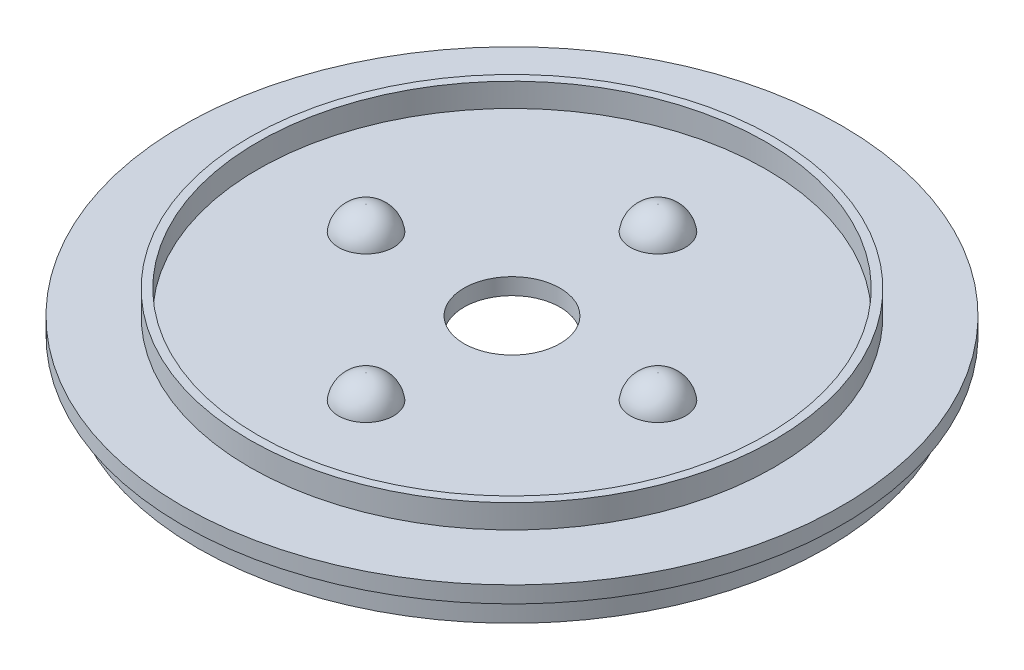
ISO-10303-21;
HEADER;
FILE_DESCRIPTION(('STEP AP214'),'2;1');
FILE_NAME('part.step','',(''),(''),'','','');
FILE_SCHEMA(('AUTOMOTIVE_DESIGN { 1 0 10303 214 1 1 1 1 }'));
ENDSEC;
DATA;
#1=APPLICATION_CONTEXT('core data for automotive mechanical design processes');
#2=APPLICATION_PROTOCOL_DEFINITION('international standard','automotive_design',2000,#1);
#3=PRODUCT_CONTEXT('',#1,'mechanical');
#4=PRODUCT('Part','Part','',(#3));
#5=PRODUCT_RELATED_PRODUCT_CATEGORY('part','',(#4));
#6=PRODUCT_DEFINITION_FORMATION('','',#4);
#7=PRODUCT_DEFINITION_CONTEXT('part definition',#1,'design');
#8=PRODUCT_DEFINITION('design','',#6,#7);
#9=PRODUCT_DEFINITION_SHAPE('','',#8);
#10=(LENGTH_UNIT() NAMED_UNIT(*) SI_UNIT(.MILLI.,.METRE.));
#11=(NAMED_UNIT(*) PLANE_ANGLE_UNIT() SI_UNIT($,.RADIAN.));
#12=(NAMED_UNIT(*) SI_UNIT($,.STERADIAN.) SOLID_ANGLE_UNIT());
#13=UNCERTAINTY_MEASURE_WITH_UNIT(LENGTH_MEASURE(1.E-05),#10,'distance_accuracy_value','');
#14=(GEOMETRIC_REPRESENTATION_CONTEXT(3) GLOBAL_UNCERTAINTY_ASSIGNED_CONTEXT((#13)) GLOBAL_UNIT_ASSIGNED_CONTEXT((#10,
#11,#12)) REPRESENTATION_CONTEXT('',''));
#15=CARTESIAN_POINT('',(0.,0.,0.));
#16=DIRECTION('',(0.,0.,1.));
#17=DIRECTION('',(1.,0.,0.));
#18=AXIS2_PLACEMENT_3D('',#15,#16,#17);
#19=CARTESIAN_POINT('',(0.,3.,0.));
#20=DIRECTION('',(0.,1.,0.));
#21=DIRECTION('',(0.,0.,1.));
#22=AXIS2_PLACEMENT_3D('',#19,#20,#21);
#23=PLANE('',#22);
#24=CARTESIAN_POINT('',(-26.5749612692967,3.,7.5014331467116E-13));
#25=DIRECTION('',(0.,1.,0.));
#26=DIRECTION('',(0.,0.,1.));
#27=AXIS2_PLACEMENT_3D('',#24,#25,#26);
#28=CIRCLE('',#27,5.00000000000118);
#29=CARTESIAN_POINT('',(-26.5749612692967,3.,5.00000000000193));
#30=VERTEX_POINT('',#29);
#31=EDGE_CURVE('E145',#30,#30,#28,.T.);
#32=ORIENTED_EDGE('',*,*,#31,.F.);
#33=EDGE_LOOP('',(#32));
#34=FACE_BOUND('',#33,.T.);
#35=CARTESIAN_POINT('',(1.49377764109114E-12,3.,26.5749612692975));
#36=DIRECTION('',(0.,1.,0.));
#37=DIRECTION('',(0.,0.,1.));
#38=AXIS2_PLACEMENT_3D('',#35,#36,#37);
#39=CIRCLE('',#38,5.00000000000158);
#40=CARTESIAN_POINT('',(1.49377764109114E-12,3.,31.574961269299));
#41=VERTEX_POINT('',#40);
#42=EDGE_CURVE('E141',#41,#41,#39,.T.);
#43=ORIENTED_EDGE('',*,*,#42,.F.);
#44=EDGE_LOOP('',(#43));
#45=FACE_BOUND('',#44,.T.);
#46=CARTESIAN_POINT('',(26.5749612692982,3.,-7.46888820545569E-13));
#47=DIRECTION('',(0.,1.,0.));
#48=DIRECTION('',(0.,0.,1.));
#49=AXIS2_PLACEMENT_3D('',#46,#47,#48);
#50=CIRCLE('',#49,5.00000000000056);
#51=CARTESIAN_POINT('',(26.5749612692982,3.,4.99999999999981));
#52=VERTEX_POINT('',#51);
#53=EDGE_CURVE('E137',#52,#52,#50,.T.);
#54=ORIENTED_EDGE('',*,*,#53,.F.);
#55=EDGE_LOOP('',(#54));
#56=FACE_BOUND('',#55,.T.);
#57=CARTESIAN_POINT('',(0.,3.,-26.5749612692975));
#58=DIRECTION('',(0.,1.,0.));
#59=DIRECTION('',(0.,0.,1.));
#60=AXIS2_PLACEMENT_3D('',#57,#58,#59);
#61=CIRCLE('',#60,5.);
#62=CARTESIAN_POINT('',(0.,3.,-21.5749612692975));
#63=VERTEX_POINT('',#62);
#64=EDGE_CURVE('E133',#63,#63,#61,.T.);
#65=ORIENTED_EDGE('',*,*,#64,.F.);
#66=EDGE_LOOP('',(#65));
#67=FACE_BOUND('',#66,.T.);
#68=CARTESIAN_POINT('',(0.,3.,0.));
#69=DIRECTION('',(0.,1.,0.));
#70=DIRECTION('',(0.,0.,1.));
#71=AXIS2_PLACEMENT_3D('',#68,#69,#70);
#72=CIRCLE('',#71,8.75);
#73=CARTESIAN_POINT('',(0.,3.,8.75));
#74=VERTEX_POINT('',#73);
#75=EDGE_CURVE('E87',#74,#74,#72,.T.);
#76=ORIENTED_EDGE('',*,*,#75,.F.);
#77=EDGE_LOOP('',(#76));
#78=FACE_BOUND('',#77,.T.);
#79=CARTESIAN_POINT('',(0.,3.,0.));
#80=DIRECTION('',(0.,1.,0.));
#81=DIRECTION('',(0.,0.,1.));
#82=AXIS2_PLACEMENT_3D('',#79,#80,#81);
#83=CIRCLE('',#82,46.25);
#84=CARTESIAN_POINT('',(0.,3.,-46.25));
#85=VERTEX_POINT('',#84);
#86=EDGE_CURVE('E71',#85,#85,#83,.F.);
#87=ORIENTED_EDGE('',*,*,#86,.F.);
#88=EDGE_LOOP('',(#87));
#89=FACE_BOUND('',#88,.T.);
#90=ADVANCED_FACE('F43',(#34,#45,#56,#67,#78,#89),#23,.T.);
#91=CARTESIAN_POINT('',(0.,0.,0.));
#92=DIRECTION('',(0.,1.,0.));
#93=DIRECTION('',(0.,0.,1.));
#94=AXIS2_PLACEMENT_3D('',#91,#92,#93);
#95=PLANE('',#94);
#96=CARTESIAN_POINT('',(0.,0.,0.));
#97=DIRECTION('',(0.,1.,0.));
#98=DIRECTION('',(0.,0.,1.));
#99=AXIS2_PLACEMENT_3D('',#96,#97,#98);
#100=CIRCLE('',#99,8.75);
#101=CARTESIAN_POINT('',(0.,0.,8.75));
#102=VERTEX_POINT('',#101);
#103=EDGE_CURVE('E91',#102,#102,#100,.T.);
#104=ORIENTED_EDGE('',*,*,#103,.T.);
#105=EDGE_LOOP('',(#104));
#106=FACE_BOUND('',#105,.T.);
#107=CARTESIAN_POINT('',(0.,0.,0.));
#108=DIRECTION('',(0.,-1.,0.));
#109=DIRECTION('',(0.,0.,-1.));
#110=AXIS2_PLACEMENT_3D('',#107,#108,#109);
#111=CIRCLE('',#110,20.5);
#112=CARTESIAN_POINT('',(0.,0.,-20.5));
#113=VERTEX_POINT('',#112);
#114=EDGE_CURVE('E115',#113,#113,#111,.T.);
#115=ORIENTED_EDGE('',*,*,#114,.T.);
#116=EDGE_LOOP('',(#115));
#117=FACE_BOUND('',#116,.T.);
#118=ADVANCED_FACE('F155',(#106,#117),#95,.F.);
#119=CARTESIAN_POINT('',(0.,0.,0.));
#120=DIRECTION('',(0.,1.,0.));
#121=DIRECTION('',(0.,0.,1.));
#122=AXIS2_PLACEMENT_3D('',#119,#120,#121);
#123=CIRCLE('',#122,22.);
#124=CARTESIAN_POINT('',(0.,0.,22.));
#125=VERTEX_POINT('',#124);
#126=EDGE_CURVE('E74',#125,#125,#123,.F.);
#127=ORIENTED_EDGE('',*,*,#126,.F.);
#128=EDGE_LOOP('',(#127));
#129=FACE_BOUND('',#128,.T.);
#130=CARTESIAN_POINT('',(0.,0.,0.));
#131=DIRECTION('',(0.,-1.,0.));
#132=DIRECTION('',(0.,0.,-1.));
#133=AXIS2_PLACEMENT_3D('',#130,#131,#132);
#134=CIRCLE('',#133,55.75);
#135=CARTESIAN_POINT('',(0.,0.,-55.75));
#136=VERTEX_POINT('',#135);
#137=EDGE_CURVE('E103',#136,#136,#134,.T.);
#138=ORIENTED_EDGE('',*,*,#137,.T.);
#139=EDGE_LOOP('',(#138));
#140=FACE_BOUND('',#139,.T.);
#141=ADVANCED_FACE('F219',(#129,#140),#95,.F.);
#142=CARTESIAN_POINT('',(0.,3.,0.));
#143=DIRECTION('',(0.,1.,0.));
#144=DIRECTION('',(0.,0.,1.));
#145=AXIS2_PLACEMENT_3D('',#142,#143,#144);
#146=CIRCLE('',#145,47.75);
#147=CARTESIAN_POINT('',(0.,3.,-47.75));
#148=VERTEX_POINT('',#147);
#149=EDGE_CURVE('E122',#148,#148,#146,.T.);
#150=ORIENTED_EDGE('',*,*,#149,.F.);
#151=EDGE_LOOP('',(#150));
#152=FACE_BOUND('',#151,.T.);
#153=CARTESIAN_POINT('',(0.,3.,0.));
#154=DIRECTION('',(0.,1.,0.));
#155=DIRECTION('',(0.,0.,1.));
#156=AXIS2_PLACEMENT_3D('',#153,#154,#155);
#157=CIRCLE('',#156,60.);
#158=CARTESIAN_POINT('',(0.,3.,60.));
#159=VERTEX_POINT('',#158);
#160=EDGE_CURVE('E82',#159,#159,#157,.T.);
#161=ORIENTED_EDGE('',*,*,#160,.T.);
#162=EDGE_LOOP('',(#161));
#163=FACE_BOUND('',#162,.T.);
#164=ADVANCED_FACE('F157',(#152,#163),#23,.T.);
#165=CARTESIAN_POINT('',(0.,0.,0.));
#166=DIRECTION('',(0.,1.,0.));
#167=DIRECTION('',(0.,0.,1.));
#168=AXIS2_PLACEMENT_3D('',#165,#166,#167);
#169=CIRCLE('',#168,57.25);
#170=CARTESIAN_POINT('',(0.,0.,57.25));
#171=VERTEX_POINT('',#170);
#172=EDGE_CURVE('E78',#171,#171,#169,.F.);
#173=ORIENTED_EDGE('',*,*,#172,.F.);
#174=EDGE_LOOP('',(#173));
#175=FACE_BOUND('',#174,.T.);
#176=CARTESIAN_POINT('',(0.,0.,0.));
#177=DIRECTION('',(0.,1.,0.));
#178=DIRECTION('',(0.,0.,1.));
#179=AXIS2_PLACEMENT_3D('',#176,#177,#178);
#180=CIRCLE('',#179,60.);
#181=CARTESIAN_POINT('',(0.,0.,60.));
#182=VERTEX_POINT('',#181);
#183=EDGE_CURVE('E83',#182,#182,#180,.T.);
#184=ORIENTED_EDGE('',*,*,#183,.F.);
#185=EDGE_LOOP('',(#184));
#186=FACE_BOUND('',#185,.T.);
#187=ADVANCED_FACE('F218',(#175,#186),#95,.F.);
#188=CARTESIAN_POINT('',(0.,3.,0.));
#189=DIRECTION('',(0.,-1.,0.));
#190=DIRECTION('',(0.,0.,-1.));
#191=AXIS2_PLACEMENT_3D('',#188,#189,#190);
#192=CYLINDRICAL_SURFACE('',#191,60.);
#193=ORIENTED_EDGE('',*,*,#160,.F.);
#194=EDGE_LOOP('',(#193));
#195=FACE_BOUND('',#194,.T.);
#196=ORIENTED_EDGE('',*,*,#183,.T.);
#197=EDGE_LOOP('',(#196));
#198=FACE_BOUND('',#197,.T.);
#199=ADVANCED_FACE('F214',(#195,#198),#192,.T.);
#200=CARTESIAN_POINT('',(0.,3.,0.));
#201=DIRECTION('',(0.,-1.,0.));
#202=DIRECTION('',(0.,0.,-1.));
#203=AXIS2_PLACEMENT_3D('',#200,#201,#202);
#204=CYLINDRICAL_SURFACE('',#203,8.75);
#205=ORIENTED_EDGE('',*,*,#75,.T.);
#206=EDGE_LOOP('',(#205));
#207=FACE_BOUND('',#206,.T.);
#208=ORIENTED_EDGE('',*,*,#103,.F.);
#209=EDGE_LOOP('',(#208));
#210=FACE_BOUND('',#209,.T.);
#211=ADVANCED_FACE('F208',(#207,#210),#204,.F.);
#212=CARTESIAN_POINT('',(0.,-5.,0.));
#213=DIRECTION('',(0.,-1.,0.));
#214=DIRECTION('',(0.,0.,-1.));
#215=AXIS2_PLACEMENT_3D('',#212,#213,#214);
#216=PLANE('',#215);
#217=CARTESIAN_POINT('',(0.,-5.,0.));
#218=DIRECTION('',(0.,-1.,0.));
#219=DIRECTION('',(0.,0.,-1.));
#220=AXIS2_PLACEMENT_3D('',#217,#218,#219);
#221=CIRCLE('',#220,57.25);
#222=CARTESIAN_POINT('',(0.,-5.,-57.25));
#223=VERTEX_POINT('',#222);
#224=EDGE_CURVE('E95',#223,#223,#221,.T.);
#225=ORIENTED_EDGE('',*,*,#224,.T.);
#226=EDGE_LOOP('',(#225));
#227=FACE_BOUND('',#226,.T.);
#228=CARTESIAN_POINT('',(0.,-5.,0.));
#229=DIRECTION('',(0.,-1.,0.));
#230=DIRECTION('',(0.,0.,-1.));
#231=AXIS2_PLACEMENT_3D('',#228,#229,#230);
#232=CIRCLE('',#231,55.75);
#233=CARTESIAN_POINT('',(0.,-5.,-55.75));
#234=VERTEX_POINT('',#233);
#235=EDGE_CURVE('E102',#234,#234,#232,.T.);
#236=ORIENTED_EDGE('',*,*,#235,.F.);
#237=EDGE_LOOP('',(#236));
#238=FACE_BOUND('',#237,.T.);
#239=ADVANCED_FACE('F205',(#227,#238),#216,.T.);
#240=CARTESIAN_POINT('',(0.,-5.,0.));
#241=DIRECTION('',(0.,1.,0.));
#242=DIRECTION('',(0.,0.,1.));
#243=AXIS2_PLACEMENT_3D('',#240,#241,#242);
#244=CYLINDRICAL_SURFACE('',#243,57.25);
#245=ORIENTED_EDGE('',*,*,#224,.F.);
#246=EDGE_LOOP('',(#245));
#247=FACE_BOUND('',#246,.T.);
#248=ORIENTED_EDGE('',*,*,#172,.T.);
#249=EDGE_LOOP('',(#248));
#250=FACE_BOUND('',#249,.T.);
#251=ADVANCED_FACE('F203',(#247,#250),#244,.T.);
#252=CARTESIAN_POINT('',(0.,-5.,0.));
#253=DIRECTION('',(0.,1.,0.));
#254=DIRECTION('',(0.,0.,1.));
#255=AXIS2_PLACEMENT_3D('',#252,#253,#254);
#256=CYLINDRICAL_SURFACE('',#255,55.75);
#257=ORIENTED_EDGE('',*,*,#235,.T.);
#258=EDGE_LOOP('',(#257));
#259=FACE_BOUND('',#258,.T.);
#260=ORIENTED_EDGE('',*,*,#137,.F.);
#261=EDGE_LOOP('',(#260));
#262=FACE_BOUND('',#261,.T.);
#263=ADVANCED_FACE('F196',(#259,#262),#256,.F.);
#264=CARTESIAN_POINT('',(0.,-7.,0.));
#265=DIRECTION('',(0.,-1.,0.));
#266=DIRECTION('',(0.,0.,-1.));
#267=AXIS2_PLACEMENT_3D('',#264,#265,#266);
#268=PLANE('',#267);
#269=CARTESIAN_POINT('',(0.,-7.,0.));
#270=DIRECTION('',(0.,-1.,0.));
#271=DIRECTION('',(0.,0.,-1.));
#272=AXIS2_PLACEMENT_3D('',#269,#270,#271);
#273=CIRCLE('',#272,22.);
#274=CARTESIAN_POINT('',(0.,-7.,-22.));
#275=VERTEX_POINT('',#274);
#276=EDGE_CURVE('E107',#275,#275,#273,.T.);
#277=ORIENTED_EDGE('',*,*,#276,.T.);
#278=EDGE_LOOP('',(#277));
#279=FACE_BOUND('',#278,.T.);
#280=CARTESIAN_POINT('',(0.,-7.,0.));
#281=DIRECTION('',(0.,-1.,0.));
#282=DIRECTION('',(0.,0.,-1.));
#283=AXIS2_PLACEMENT_3D('',#280,#281,#282);
#284=CIRCLE('',#283,20.5);
#285=CARTESIAN_POINT('',(0.,-7.,-20.5));
#286=VERTEX_POINT('',#285);
#287=EDGE_CURVE('E114',#286,#286,#284,.T.);
#288=ORIENTED_EDGE('',*,*,#287,.F.);
#289=EDGE_LOOP('',(#288));
#290=FACE_BOUND('',#289,.T.);
#291=ADVANCED_FACE('F193',(#279,#290),#268,.T.);
#292=CARTESIAN_POINT('',(0.,-7.,0.));
#293=DIRECTION('',(0.,1.,0.));
#294=DIRECTION('',(0.,0.,1.));
#295=AXIS2_PLACEMENT_3D('',#292,#293,#294);
#296=CYLINDRICAL_SURFACE('',#295,22.);
#297=ORIENTED_EDGE('',*,*,#276,.F.);
#298=EDGE_LOOP('',(#297));
#299=FACE_BOUND('',#298,.T.);
#300=ORIENTED_EDGE('',*,*,#126,.T.);
#301=EDGE_LOOP('',(#300));
#302=FACE_BOUND('',#301,.T.);
#303=ADVANCED_FACE('F191',(#299,#302),#296,.T.);
#304=CARTESIAN_POINT('',(0.,-7.,0.));
#305=DIRECTION('',(0.,1.,0.));
#306=DIRECTION('',(0.,0.,1.));
#307=AXIS2_PLACEMENT_3D('',#304,#305,#306);
#308=CYLINDRICAL_SURFACE('',#307,20.5);
#309=ORIENTED_EDGE('',*,*,#287,.T.);
#310=EDGE_LOOP('',(#309));
#311=FACE_BOUND('',#310,.T.);
#312=ORIENTED_EDGE('',*,*,#114,.F.);
#313=EDGE_LOOP('',(#312));
#314=FACE_BOUND('',#313,.T.);
#315=ADVANCED_FACE('F186',(#311,#314),#308,.F.);
#316=CARTESIAN_POINT('',(0.,7.3,0.));
#317=DIRECTION('',(0.,1.,0.));
#318=DIRECTION('',(0.,0.,1.));
#319=AXIS2_PLACEMENT_3D('',#316,#317,#318);
#320=PLANE('',#319);
#321=CARTESIAN_POINT('',(0.,7.3,0.));
#322=DIRECTION('',(0.,1.,0.));
#323=DIRECTION('',(0.,0.,1.));
#324=AXIS2_PLACEMENT_3D('',#321,#322,#323);
#325=CIRCLE('',#324,47.75);
#326=CARTESIAN_POINT('',(0.,7.3,-47.75));
#327=VERTEX_POINT('',#326);
#328=EDGE_CURVE('E119',#327,#327,#325,.T.);
#329=ORIENTED_EDGE('',*,*,#328,.T.);
#330=EDGE_LOOP('',(#329));
#331=FACE_BOUND('',#330,.T.);
#332=CARTESIAN_POINT('',(0.,7.3,0.));
#333=DIRECTION('',(0.,1.,0.));
#334=DIRECTION('',(0.,0.,1.));
#335=AXIS2_PLACEMENT_3D('',#332,#333,#334);
#336=CIRCLE('',#335,46.25);
#337=CARTESIAN_POINT('',(0.,7.3,-46.25));
#338=VERTEX_POINT('',#337);
#339=EDGE_CURVE('E126',#338,#338,#336,.T.);
#340=ORIENTED_EDGE('',*,*,#339,.F.);
#341=EDGE_LOOP('',(#340));
#342=FACE_BOUND('',#341,.T.);
#343=ADVANCED_FACE('F180',(#331,#342),#320,.T.);
#344=CARTESIAN_POINT('',(0.,7.3,0.));
#345=DIRECTION('',(0.,-1.,0.));
#346=DIRECTION('',(0.,0.,-1.));
#347=AXIS2_PLACEMENT_3D('',#344,#345,#346);
#348=CYLINDRICAL_SURFACE('',#347,47.75);
#349=CARTESIAN_POINT('',(0.,7.3,-47.75));
#350=CARTESIAN_POINT('',(0.,7.25520833333333,-47.75));
#351=CARTESIAN_POINT('',(0.,7.21041666666667,-47.75));
#352=CARTESIAN_POINT('',(0.,7.12083333333333,-47.75));
#353=CARTESIAN_POINT('',(0.,7.07604166666667,-47.75));
#354=CARTESIAN_POINT('',(0.,6.98645833333333,-47.75));
#355=CARTESIAN_POINT('',(0.,6.94166666666667,-47.75));
#356=CARTESIAN_POINT('',(0.,6.85208333333333,-47.75));
#357=CARTESIAN_POINT('',(0.,6.80729166666667,-47.75));
#358=CARTESIAN_POINT('',(0.,6.71770833333333,-47.75));
#359=CARTESIAN_POINT('',(0.,6.67291666666667,-47.75));
#360=CARTESIAN_POINT('',(0.,6.58333333333333,-47.75));
#361=CARTESIAN_POINT('',(0.,6.53854166666667,-47.75));
#362=CARTESIAN_POINT('',(0.,6.44895833333333,-47.75));
#363=CARTESIAN_POINT('',(0.,6.40416666666667,-47.75));
#364=CARTESIAN_POINT('',(0.,6.31458333333333,-47.75));
#365=CARTESIAN_POINT('',(0.,6.26979166666667,-47.75));
#366=CARTESIAN_POINT('',(0.,6.18020833333333,-47.75));
#367=CARTESIAN_POINT('',(0.,6.13541666666667,-47.75));
#368=CARTESIAN_POINT('',(0.,6.04583333333333,-47.75));
#369=CARTESIAN_POINT('',(0.,6.00104166666667,-47.75));
#370=CARTESIAN_POINT('',(0.,5.91145833333333,-47.75));
#371=CARTESIAN_POINT('',(0.,5.86666666666667,-47.75));
#372=CARTESIAN_POINT('',(0.,5.77708333333333,-47.75));
#373=CARTESIAN_POINT('',(0.,5.73229166666667,-47.75));
#374=CARTESIAN_POINT('',(0.,5.64270833333333,-47.75));
#375=CARTESIAN_POINT('',(0.,5.59791666666667,-47.75));
#376=CARTESIAN_POINT('',(0.,5.50833333333333,-47.75));
#377=CARTESIAN_POINT('',(0.,5.46354166666667,-47.75));
#378=CARTESIAN_POINT('',(0.,5.37395833333333,-47.75));
#379=CARTESIAN_POINT('',(0.,5.32916666666667,-47.75));
#380=CARTESIAN_POINT('',(0.,5.23958333333333,-47.75));
#381=CARTESIAN_POINT('',(0.,5.19479166666667,-47.75));
#382=CARTESIAN_POINT('',(0.,5.10520833333333,-47.75));
#383=CARTESIAN_POINT('',(0.,5.06041666666667,-47.75));
#384=CARTESIAN_POINT('',(0.,4.97083333333333,-47.75));
#385=CARTESIAN_POINT('',(0.,4.92604166666667,-47.75));
#386=CARTESIAN_POINT('',(0.,4.83645833333333,-47.75));
#387=CARTESIAN_POINT('',(0.,4.79166666666667,-47.75));
#388=CARTESIAN_POINT('',(0.,4.70208333333333,-47.75));
#389=CARTESIAN_POINT('',(0.,4.65729166666667,-47.75));
#390=CARTESIAN_POINT('',(0.,4.56770833333333,-47.75));
#391=CARTESIAN_POINT('',(0.,4.52291666666667,-47.75));
#392=CARTESIAN_POINT('',(0.,4.43333333333333,-47.75));
#393=CARTESIAN_POINT('',(0.,4.38854166666667,-47.75));
#394=CARTESIAN_POINT('',(0.,4.29895833333333,-47.75));
#395=CARTESIAN_POINT('',(0.,4.25416666666667,-47.75));
#396=CARTESIAN_POINT('',(0.,4.16458333333333,-47.75));
#397=CARTESIAN_POINT('',(0.,4.11979166666667,-47.75));
#398=CARTESIAN_POINT('',(0.,4.03020833333333,-47.75));
#399=CARTESIAN_POINT('',(0.,3.98541666666667,-47.75));
#400=CARTESIAN_POINT('',(0.,3.89583333333333,-47.75));
#401=CARTESIAN_POINT('',(0.,3.85104166666667,-47.75));
#402=CARTESIAN_POINT('',(0.,3.76145833333333,-47.75));
#403=CARTESIAN_POINT('',(0.,3.71666666666667,-47.75));
#404=CARTESIAN_POINT('',(0.,3.62708333333333,-47.75));
#405=CARTESIAN_POINT('',(0.,3.58229166666667,-47.75));
#406=CARTESIAN_POINT('',(0.,3.49270833333333,-47.75));
#407=CARTESIAN_POINT('',(0.,3.44791666666667,-47.75));
#408=CARTESIAN_POINT('',(0.,3.35833333333333,-47.75));
#409=CARTESIAN_POINT('',(0.,3.31354166666667,-47.75));
#410=CARTESIAN_POINT('',(0.,3.22395833333333,-47.75));
#411=CARTESIAN_POINT('',(0.,3.17916666666667,-47.75));
#412=CARTESIAN_POINT('',(0.,3.08958333333333,-47.75));
#413=CARTESIAN_POINT('',(0.,3.04479166666667,-47.75));
#414=CARTESIAN_POINT('',(0.,3.,-47.75));
#415=B_SPLINE_CURVE_WITH_KNOTS('',3,(#349,#350,#351,#352,#353,#354,#355,#356,#357,#358,#359,
#360,#361,#362,#363,#364,#365,#366,#367,#368,#369,#370,#371,#372,#373,#374,#375,#376,#377,#378,
#379,#380,#381,#382,#383,#384,#385,#386,#387,#388,#389,#390,#391,#392,#393,#394,#395,#396,#397,
#398,#399,#400,#401,#402,#403,#404,#405,#406,#407,#408,#409,#410,#411,#412,#413,#414),
.UNSPECIFIED.,.F.,.F.,(4,2,2,2,2,2,2,2,2,2,2,2,2,2,2,2,2,2,2,2,2,2,2,2,2,2,2,2,2,2,2,2,4),(0.,
0.134375,0.26875,0.403125,0.5375,0.671875,0.80625,0.940625,1.075,1.209375,1.34375,1.478125,
1.6125,1.746875,1.88125,2.015625,2.15,2.284375,2.41875,2.553125,2.6875,2.821875,2.95625,
3.090625,3.225,3.359375,3.49375,3.628125,3.7625,3.896875,4.03125,4.165625,4.3),.UNSPECIFIED.);
#416=EDGE_CURVE('BSEAM171',#327,#148,#415,.T.);
#417=ORIENTED_EDGE('',*,*,#328,.F.);
#418=ORIENTED_EDGE('',*,*,#149,.T.);
#419=ORIENTED_EDGE('',*,*,#416,.T.);
#420=ORIENTED_EDGE('',*,*,#416,.F.);
#421=EDGE_LOOP('',(#417,#419,#418,#420));
#422=FACE_BOUND('',#421,.T.);
#423=ADVANCED_FACE('F171',(#422),#348,.T.);
#424=CARTESIAN_POINT('',(0.,7.3,0.));
#425=DIRECTION('',(0.,-1.,0.));
#426=DIRECTION('',(0.,0.,-1.));
#427=AXIS2_PLACEMENT_3D('',#424,#425,#426);
#428=CYLINDRICAL_SURFACE('',#427,46.25);
#429=CARTESIAN_POINT('',(0.,7.3,-46.25));
#430=CARTESIAN_POINT('',(0.,7.25520833333333,-46.25));
#431=CARTESIAN_POINT('',(0.,7.21041666666667,-46.25));
#432=CARTESIAN_POINT('',(0.,7.12083333333333,-46.25));
#433=CARTESIAN_POINT('',(0.,7.07604166666667,-46.25));
#434=CARTESIAN_POINT('',(0.,6.98645833333333,-46.25));
#435=CARTESIAN_POINT('',(0.,6.94166666666667,-46.25));
#436=CARTESIAN_POINT('',(0.,6.85208333333333,-46.25));
#437=CARTESIAN_POINT('',(0.,6.80729166666667,-46.25));
#438=CARTESIAN_POINT('',(0.,6.71770833333333,-46.25));
#439=CARTESIAN_POINT('',(0.,6.67291666666667,-46.25));
#440=CARTESIAN_POINT('',(0.,6.58333333333333,-46.25));
#441=CARTESIAN_POINT('',(0.,6.53854166666667,-46.25));
#442=CARTESIAN_POINT('',(0.,6.44895833333333,-46.25));
#443=CARTESIAN_POINT('',(0.,6.40416666666667,-46.25));
#444=CARTESIAN_POINT('',(0.,6.31458333333333,-46.25));
#445=CARTESIAN_POINT('',(0.,6.26979166666667,-46.25));
#446=CARTESIAN_POINT('',(0.,6.18020833333333,-46.25));
#447=CARTESIAN_POINT('',(0.,6.13541666666667,-46.25));
#448=CARTESIAN_POINT('',(0.,6.04583333333333,-46.25));
#449=CARTESIAN_POINT('',(0.,6.00104166666667,-46.25));
#450=CARTESIAN_POINT('',(0.,5.91145833333333,-46.25));
#451=CARTESIAN_POINT('',(0.,5.86666666666667,-46.25));
#452=CARTESIAN_POINT('',(0.,5.77708333333333,-46.25));
#453=CARTESIAN_POINT('',(0.,5.73229166666667,-46.25));
#454=CARTESIAN_POINT('',(0.,5.64270833333333,-46.25));
#455=CARTESIAN_POINT('',(0.,5.59791666666667,-46.25));
#456=CARTESIAN_POINT('',(0.,5.50833333333333,-46.25));
#457=CARTESIAN_POINT('',(0.,5.46354166666667,-46.25));
#458=CARTESIAN_POINT('',(0.,5.37395833333333,-46.25));
#459=CARTESIAN_POINT('',(0.,5.32916666666667,-46.25));
#460=CARTESIAN_POINT('',(0.,5.23958333333333,-46.25));
#461=CARTESIAN_POINT('',(0.,5.19479166666667,-46.25));
#462=CARTESIAN_POINT('',(0.,5.10520833333333,-46.25));
#463=CARTESIAN_POINT('',(0.,5.06041666666667,-46.25));
#464=CARTESIAN_POINT('',(0.,4.97083333333333,-46.25));
#465=CARTESIAN_POINT('',(0.,4.92604166666667,-46.25));
#466=CARTESIAN_POINT('',(0.,4.83645833333333,-46.25));
#467=CARTESIAN_POINT('',(0.,4.79166666666667,-46.25));
#468=CARTESIAN_POINT('',(0.,4.70208333333333,-46.25));
#469=CARTESIAN_POINT('',(0.,4.65729166666667,-46.25));
#470=CARTESIAN_POINT('',(0.,4.56770833333333,-46.25));
#471=CARTESIAN_POINT('',(0.,4.52291666666667,-46.25));
#472=CARTESIAN_POINT('',(0.,4.43333333333333,-46.25));
#473=CARTESIAN_POINT('',(0.,4.38854166666667,-46.25));
#474=CARTESIAN_POINT('',(0.,4.29895833333333,-46.25));
#475=CARTESIAN_POINT('',(0.,4.25416666666667,-46.25));
#476=CARTESIAN_POINT('',(0.,4.16458333333333,-46.25));
#477=CARTESIAN_POINT('',(0.,4.11979166666667,-46.25));
#478=CARTESIAN_POINT('',(0.,4.03020833333333,-46.25));
#479=CARTESIAN_POINT('',(0.,3.98541666666667,-46.25));
#480=CARTESIAN_POINT('',(0.,3.89583333333333,-46.25));
#481=CARTESIAN_POINT('',(0.,3.85104166666667,-46.25));
#482=CARTESIAN_POINT('',(0.,3.76145833333333,-46.25));
#483=CARTESIAN_POINT('',(0.,3.71666666666667,-46.25));
#484=CARTESIAN_POINT('',(0.,3.62708333333333,-46.25));
#485=CARTESIAN_POINT('',(0.,3.58229166666667,-46.25));
#486=CARTESIAN_POINT('',(0.,3.49270833333333,-46.25));
#487=CARTESIAN_POINT('',(0.,3.44791666666667,-46.25));
#488=CARTESIAN_POINT('',(0.,3.35833333333333,-46.25));
#489=CARTESIAN_POINT('',(0.,3.31354166666667,-46.25));
#490=CARTESIAN_POINT('',(0.,3.22395833333333,-46.25));
#491=CARTESIAN_POINT('',(0.,3.17916666666667,-46.25));
#492=CARTESIAN_POINT('',(0.,3.08958333333333,-46.25));
#493=CARTESIAN_POINT('',(0.,3.04479166666667,-46.25));
#494=CARTESIAN_POINT('',(0.,3.,-46.25));
#495=B_SPLINE_CURVE_WITH_KNOTS('',3,(#429,#430,#431,#432,#433,#434,#435,#436,#437,#438,#439,
#440,#441,#442,#443,#444,#445,#446,#447,#448,#449,#450,#451,#452,#453,#454,#455,#456,#457,#458,
#459,#460,#461,#462,#463,#464,#465,#466,#467,#468,#469,#470,#471,#472,#473,#474,#475,#476,#477,
#478,#479,#480,#481,#482,#483,#484,#485,#486,#487,#488,#489,#490,#491,#492,#493,#494),
.UNSPECIFIED.,.F.,.F.,(4,2,2,2,2,2,2,2,2,2,2,2,2,2,2,2,2,2,2,2,2,2,2,2,2,2,2,2,2,2,2,2,4),(0.,
0.134375000000001,0.268750000000001,0.403125000000001,0.537500000000001,0.671875000000001,
0.806250000000001,0.940625,1.075,1.209375,1.34375,1.478125,1.6125,1.746875,1.88125,2.015625,
2.15,2.284375,2.41875,2.553125,2.6875,2.821875,2.95625,3.090625,3.225,3.359375,3.49375,3.628125,
3.7625,3.896875,4.03125,4.165625,4.3),.UNSPECIFIED.);
#496=EDGE_CURVE('BSEAM168',#338,#85,#495,.T.);
#497=ORIENTED_EDGE('',*,*,#339,.T.);
#498=ORIENTED_EDGE('',*,*,#86,.T.);
#499=ORIENTED_EDGE('',*,*,#496,.T.);
#500=ORIENTED_EDGE('',*,*,#496,.F.);
#501=EDGE_LOOP('',(#497,#499,#498,#500));
#502=FACE_BOUND('',#501,.T.);
#503=ADVANCED_FACE('F168',(#502),#428,.F.);
#504=CARTESIAN_POINT('',(0.,7.3,0.));
#505=DIRECTION('',(0.,1.,0.));
#506=DIRECTION('',(0.,0.,1.));
#507=AXIS2_PLACEMENT_3D('',#504,#505,#506);
#508=PLANE('',#507);
#509=CARTESIAN_POINT('',(0.,7.3,-26.5749612692975));
#510=DIRECTION('',(0.,1.,0.));
#511=DIRECTION('',(0.,0.,1.));
#512=AXIS2_PLACEMENT_3D('',#509,#510,#511);
#513=CIRCLE('',#512,0.049242482205376);
#514=CARTESIAN_POINT('',(0.,7.3,-26.5257187870921));
#515=VERTEX_POINT('',#514);
#516=EDGE_CURVE('E51',#515,#515,#513,.T.);
#517=ORIENTED_EDGE('',*,*,#516,.T.);
#518=EDGE_LOOP('',(#517));
#519=FACE_BOUND('',#518,.T.);
#520=ADVANCED_FACE('F170',(#519),#508,.T.);
#521=CARTESIAN_POINT('',(0.,7.3,0.));
#522=DIRECTION('',(0.,1.,0.));
#523=DIRECTION('',(0.,0.,1.));
#524=AXIS2_PLACEMENT_3D('',#521,#522,#523);
#525=PLANE('',#524);
#526=CARTESIAN_POINT('',(26.5749612692982,7.3,-7.46888820545569E-13));
#527=DIRECTION('',(0.,1.,0.));
#528=DIRECTION('',(0.,0.,1.));
#529=AXIS2_PLACEMENT_3D('',#526,#527,#528);
#530=CIRCLE('',#529,0.0492424822059346);
#531=CARTESIAN_POINT('',(26.5749612692982,7.3,0.0492424822051877));
#532=VERTEX_POINT('',#531);
#533=EDGE_CURVE('E58',#532,#532,#530,.T.);
#534=ORIENTED_EDGE('',*,*,#533,.T.);
#535=EDGE_LOOP('',(#534));
#536=FACE_BOUND('',#535,.T.);
#537=ADVANCED_FACE('F178',(#536),#525,.T.);
#538=CARTESIAN_POINT('',(0.,7.3,0.));
#539=DIRECTION('',(0.,1.,0.));
#540=DIRECTION('',(0.,0.,1.));
#541=AXIS2_PLACEMENT_3D('',#538,#539,#540);
#542=PLANE('',#541);
#543=CARTESIAN_POINT('',(1.49377764109114E-12,7.3,26.5749612692975));
#544=DIRECTION('',(0.,1.,0.));
#545=DIRECTION('',(0.,0.,1.));
#546=AXIS2_PLACEMENT_3D('',#543,#544,#545);
#547=CIRCLE('',#546,0.0492424822069546);
#548=CARTESIAN_POINT('',(1.49377764109114E-12,7.3,26.6242037515044));
#549=VERTEX_POINT('',#548);
#550=EDGE_CURVE('E65',#549,#549,#547,.T.);
#551=ORIENTED_EDGE('',*,*,#550,.T.);
#552=EDGE_LOOP('',(#551));
#553=FACE_BOUND('',#552,.T.);
#554=ADVANCED_FACE('F267',(#553),#542,.T.);
#555=CARTESIAN_POINT('',(0.,7.3,0.));
#556=DIRECTION('',(0.,1.,0.));
#557=DIRECTION('',(0.,0.,1.));
#558=AXIS2_PLACEMENT_3D('',#555,#556,#557);
#559=PLANE('',#558);
#560=CARTESIAN_POINT('',(-26.5749612692967,7.3,7.5014331467116E-13));
#561=DIRECTION('',(0.,1.,0.));
#562=DIRECTION('',(0.,0.,1.));
#563=AXIS2_PLACEMENT_3D('',#560,#561,#562);
#564=CIRCLE('',#563,0.0492424822065522);
#565=CARTESIAN_POINT('',(-26.5749612692967,7.3,0.0492424822073023));
#566=VERTEX_POINT('',#565);
#567=EDGE_CURVE('E10',#566,#566,#564,.T.);
#568=ORIENTED_EDGE('',*,*,#567,.T.);
#569=EDGE_LOOP('',(#568));
#570=FACE_BOUND('',#569,.T.);
#571=ADVANCED_FACE('F231',(#570),#559,.T.);
#572=CARTESIAN_POINT('',(1.49377764109114E-12,2.3,26.5749612692975));
#573=DIRECTION('',(0.,-1.,0.));
#574=DIRECTION('',(0.,0.,-1.));
#575=AXIS2_PLACEMENT_3D('',#572,#573,#574);
#576=DEGENERATE_TOROIDAL_SURFACE('',#575,0.0492424822069546,5.,.T.);
#577=ORIENTED_EDGE('',*,*,#42,.T.);
#578=EDGE_LOOP('',(#577));
#579=FACE_BOUND('',#578,.T.);
#580=ORIENTED_EDGE('',*,*,#550,.F.);
#581=EDGE_LOOP('',(#580));
#582=FACE_BOUND('',#581,.T.);
#583=ADVANCED_FACE('F227',(#579,#582),#576,.T.);
#584=CARTESIAN_POINT('',(26.5749612692982,2.3,-7.46888820545569E-13));
#585=DIRECTION('',(0.,-1.,0.));
#586=DIRECTION('',(0.,0.,-1.));
#587=AXIS2_PLACEMENT_3D('',#584,#585,#586);
#588=DEGENERATE_TOROIDAL_SURFACE('',#587,0.0492424822059346,5.,.T.);
#589=ORIENTED_EDGE('',*,*,#53,.T.);
#590=EDGE_LOOP('',(#589));
#591=FACE_BOUND('',#590,.T.);
#592=ORIENTED_EDGE('',*,*,#533,.F.);
#593=EDGE_LOOP('',(#592));
#594=FACE_BOUND('',#593,.T.);
#595=ADVANCED_FACE('F230',(#591,#594),#588,.T.);
#596=CARTESIAN_POINT('',(0.,2.3,-26.5749612692975));
#597=DIRECTION('',(0.,-1.,0.));
#598=DIRECTION('',(0.,0.,-1.));
#599=AXIS2_PLACEMENT_3D('',#596,#597,#598);
#600=DEGENERATE_TOROIDAL_SURFACE('',#599,0.049242482205376,5.,.T.);
#601=ORIENTED_EDGE('',*,*,#64,.T.);
#602=EDGE_LOOP('',(#601));
#603=FACE_BOUND('',#602,.T.);
#604=ORIENTED_EDGE('',*,*,#516,.F.);
#605=EDGE_LOOP('',(#604));
#606=FACE_BOUND('',#605,.T.);
#607=ADVANCED_FACE('F234',(#603,#606),#600,.T.);
#608=CARTESIAN_POINT('',(-26.5749612692967,2.3,7.5014331467116E-13));
#609=DIRECTION('',(0.,-1.,0.));
#610=DIRECTION('',(0.,0.,-1.));
#611=AXIS2_PLACEMENT_3D('',#608,#609,#610);
#612=DEGENERATE_TOROIDAL_SURFACE('',#611,0.0492424822065522,5.,.T.);
#613=ORIENTED_EDGE('',*,*,#31,.T.);
#614=EDGE_LOOP('',(#613));
#615=FACE_BOUND('',#614,.T.);
#616=ORIENTED_EDGE('',*,*,#567,.F.);
#617=EDGE_LOOP('',(#616));
#618=FACE_BOUND('',#617,.T.);
#619=ADVANCED_FACE('F45',(#615,#618),#612,.T.);
#620=CLOSED_SHELL('',(#90,#118,#141,#164,#187,#199,#211,#239,#251,#263,#291,#303,#315,#343,#423,
#503,#520,#537,#554,#571,#583,#595,#607,#619));
#621=MANIFOLD_SOLID_BREP('B2',#620);
#622=ADVANCED_BREP_SHAPE_REPRESENTATION('',(#18,#621),#14);
#623=SHAPE_DEFINITION_REPRESENTATION(#9,#622);
ENDSEC;
END-ISO-10303-21;
